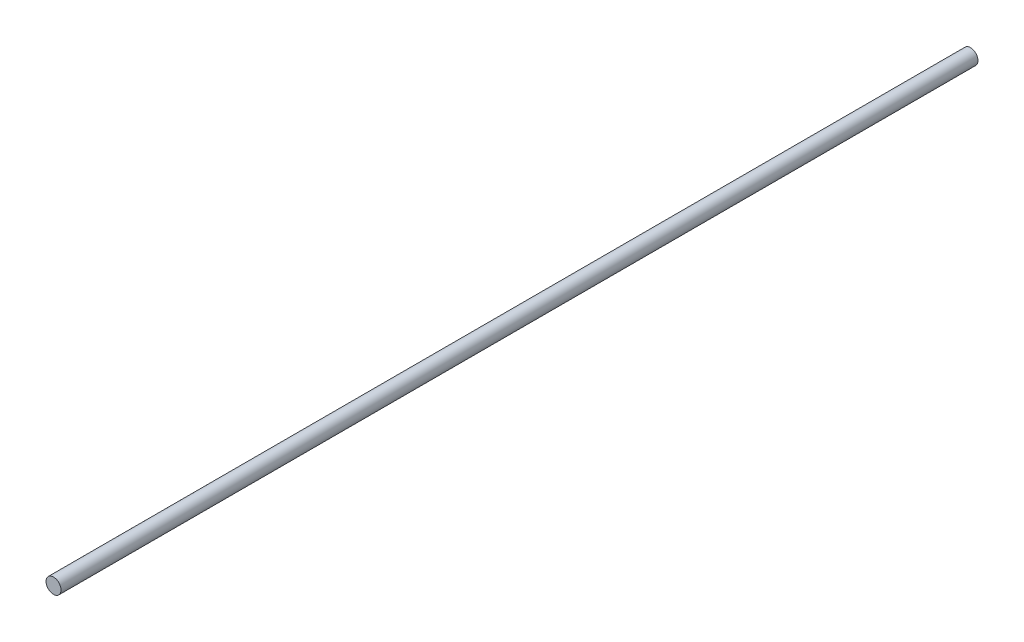
ISO-10303-21;
HEADER;
FILE_DESCRIPTION(('STEP AP214'),'2;1');
FILE_NAME('part.step','',(''),(''),'','','');
FILE_SCHEMA(('AUTOMOTIVE_DESIGN { 1 0 10303 214 1 1 1 1 }'));
ENDSEC;
DATA;
#1=APPLICATION_CONTEXT('core data for automotive mechanical design processes');
#2=APPLICATION_PROTOCOL_DEFINITION('international standard','automotive_design',2000,#1);
#3=PRODUCT_CONTEXT('',#1,'mechanical');
#4=PRODUCT('Part','Part','',(#3));
#5=PRODUCT_RELATED_PRODUCT_CATEGORY('part','',(#4));
#6=PRODUCT_DEFINITION_FORMATION('','',#4);
#7=PRODUCT_DEFINITION_CONTEXT('part definition',#1,'design');
#8=PRODUCT_DEFINITION('design','',#6,#7);
#9=PRODUCT_DEFINITION_SHAPE('','',#8);
#10=(LENGTH_UNIT() NAMED_UNIT(*) SI_UNIT(.MILLI.,.METRE.));
#11=(NAMED_UNIT(*) PLANE_ANGLE_UNIT() SI_UNIT($,.RADIAN.));
#12=(NAMED_UNIT(*) SI_UNIT($,.STERADIAN.) SOLID_ANGLE_UNIT());
#13=UNCERTAINTY_MEASURE_WITH_UNIT(LENGTH_MEASURE(1.E-05),#10,'distance_accuracy_value','');
#14=(GEOMETRIC_REPRESENTATION_CONTEXT(3) GLOBAL_UNCERTAINTY_ASSIGNED_CONTEXT((#13)) GLOBAL_UNIT_ASSIGNED_CONTEXT((#10,
#11,#12)) REPRESENTATION_CONTEXT('',''));
#15=CARTESIAN_POINT('',(0.,0.,0.));
#16=DIRECTION('',(0.,0.,1.));
#17=DIRECTION('',(1.,0.,0.));
#18=AXIS2_PLACEMENT_3D('',#15,#16,#17);
#19=CARTESIAN_POINT('',(0.,0.,152.4));
#20=DIRECTION('',(0.,0.,-1.));
#21=DIRECTION('',(-1.,0.,0.));
#22=AXIS2_PLACEMENT_3D('',#19,#20,#21);
#23=CYLINDRICAL_SURFACE('',#22,2.5);
#24=CARTESIAN_POINT('',(0.,0.,152.4));
#25=DIRECTION('',(0.,0.,1.));
#26=DIRECTION('',(1.,0.,0.));
#27=AXIS2_PLACEMENT_3D('',#24,#25,#26);
#28=CIRCLE('',#27,2.5);
#29=CARTESIAN_POINT('',(2.5,0.,152.4));
#30=VERTEX_POINT('',#29);
#31=EDGE_CURVE('E10',#30,#30,#28,.T.);
#32=ORIENTED_EDGE('',*,*,#31,.F.);
#33=EDGE_LOOP('',(#32));
#34=FACE_BOUND('',#33,.T.);
#35=CARTESIAN_POINT('',(0.,0.,-152.4));
#36=DIRECTION('',(0.,0.,1.));
#37=DIRECTION('',(1.,0.,0.));
#38=AXIS2_PLACEMENT_3D('',#35,#36,#37);
#39=CIRCLE('',#38,2.5);
#40=CARTESIAN_POINT('',(2.5,0.,-152.4));
#41=VERTEX_POINT('',#40);
#42=EDGE_CURVE('E34',#41,#41,#39,.T.);
#43=ORIENTED_EDGE('',*,*,#42,.T.);
#44=EDGE_LOOP('',(#43));
#45=FACE_BOUND('',#44,.T.);
#46=ADVANCED_FACE('F28',(#34,#45),#23,.T.);
#47=CARTESIAN_POINT('',(0.,0.,152.4));
#48=DIRECTION('',(0.,0.,1.));
#49=DIRECTION('',(1.,0.,0.));
#50=AXIS2_PLACEMENT_3D('',#47,#48,#49);
#51=PLANE('',#50);
#52=ORIENTED_EDGE('',*,*,#31,.T.);
#53=EDGE_LOOP('',(#52));
#54=FACE_BOUND('',#53,.T.);
#55=ADVANCED_FACE('F43',(#54),#51,.T.);
#56=CARTESIAN_POINT('',(0.,0.,-152.4));
#57=DIRECTION('',(0.,0.,1.));
#58=DIRECTION('',(1.,0.,0.));
#59=AXIS2_PLACEMENT_3D('',#56,#57,#58);
#60=PLANE('',#59);
#61=ORIENTED_EDGE('',*,*,#42,.F.);
#62=EDGE_LOOP('',(#61));
#63=FACE_BOUND('',#62,.T.);
#64=ADVANCED_FACE('F41',(#63),#60,.F.);
#65=CLOSED_SHELL('',(#46,#55,#64));
#66=MANIFOLD_SOLID_BREP('B2',#65);
#67=ADVANCED_BREP_SHAPE_REPRESENTATION('',(#18,#66),#14);
#68=SHAPE_DEFINITION_REPRESENTATION(#9,#67);
ENDSEC;
END-ISO-10303-21;
